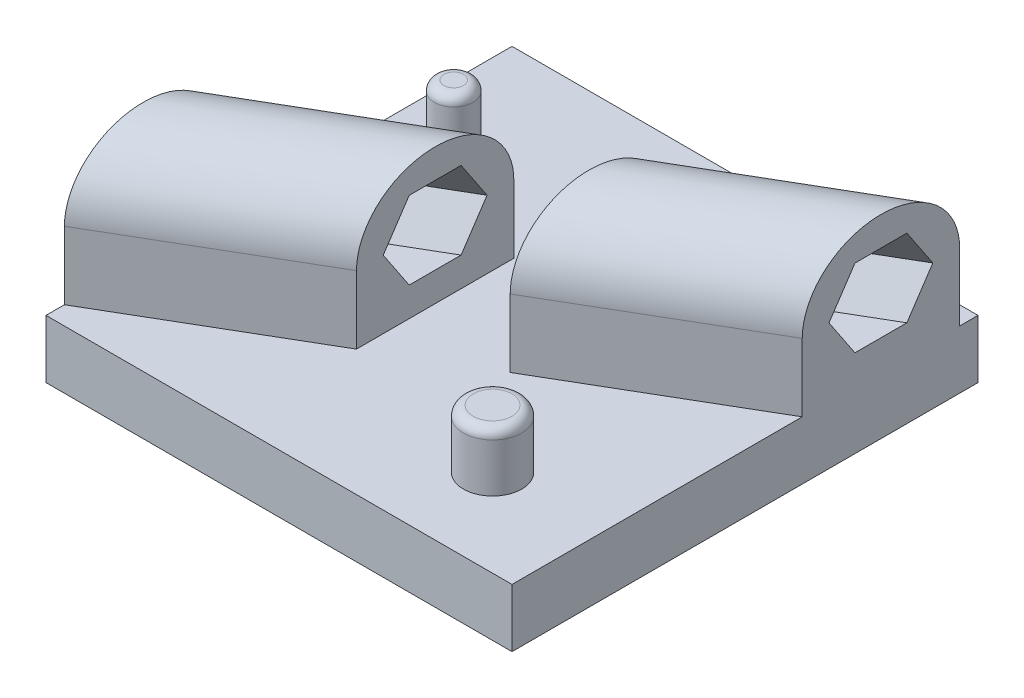
ISO-10303-21;
HEADER;
FILE_DESCRIPTION(('STEP AP214'),'2;1');
FILE_NAME('part.step','',(''),(''),'','','');
FILE_SCHEMA(('AUTOMOTIVE_DESIGN { 1 0 10303 214 1 1 1 1 }'));
ENDSEC;
DATA;
#1=APPLICATION_CONTEXT('core data for automotive mechanical design processes');
#2=APPLICATION_PROTOCOL_DEFINITION('international standard','automotive_design',2000,#1);
#3=PRODUCT_CONTEXT('',#1,'mechanical');
#4=PRODUCT('Part','Part','',(#3));
#5=PRODUCT_RELATED_PRODUCT_CATEGORY('part','',(#4));
#6=PRODUCT_DEFINITION_FORMATION('','',#4);
#7=PRODUCT_DEFINITION_CONTEXT('part definition',#1,'design');
#8=PRODUCT_DEFINITION('design','',#6,#7);
#9=PRODUCT_DEFINITION_SHAPE('','',#8);
#10=(LENGTH_UNIT() NAMED_UNIT(*) SI_UNIT(.MILLI.,.METRE.));
#11=(NAMED_UNIT(*) PLANE_ANGLE_UNIT() SI_UNIT($,.RADIAN.));
#12=(NAMED_UNIT(*) SI_UNIT($,.STERADIAN.) SOLID_ANGLE_UNIT());
#13=UNCERTAINTY_MEASURE_WITH_UNIT(LENGTH_MEASURE(1.E-05),#10,'distance_accuracy_value','');
#14=(GEOMETRIC_REPRESENTATION_CONTEXT(3) GLOBAL_UNCERTAINTY_ASSIGNED_CONTEXT((#13)) GLOBAL_UNIT_ASSIGNED_CONTEXT((#10,
#11,#12)) REPRESENTATION_CONTEXT('',''));
#15=CARTESIAN_POINT('',(0.,0.,0.));
#16=DIRECTION('',(0.,0.,1.));
#17=DIRECTION('',(1.,0.,0.));
#18=AXIS2_PLACEMENT_3D('',#15,#16,#17);
#19=CARTESIAN_POINT('',(-240.249167329031,0.,99.6257193060394));
#20=DIRECTION('',(-0.503871025524086,0.,-0.863778900898433));
#21=DIRECTION('',(-0.863778900898433,0.,0.503871025524086));
#22=AXIS2_PLACEMENT_3D('',#19,#20,#21);
#23=PLANE('',#22);
#24=DIRECTION('',(0.,1.,0.));
#25=VECTOR('',#24,1.);
#26=CARTESIAN_POINT('',(-25.,0.,-25.9362949692286));
#27=LINE('',#26,#25);
#28=CARTESIAN_POINT('',(-25.,15.,-25.9362949692286));
#29=VERTEX_POINT('',#28);
#30=CARTESIAN_POINT('',(-25.,50.,-25.9362949692286));
#31=VERTEX_POINT('',#30);
#32=EDGE_CURVE('E399',#29,#31,#27,.T.);
#33=ORIENTED_EDGE('',*,*,#32,.F.);
#34=DIRECTION('',(0.863778900898433,0.,-0.503871025524086));
#35=VECTOR('',#34,1.);
#36=CARTESIAN_POINT('',(19.6702135885223,15.,-51.9939195625333));
#37=LINE('',#36,#35);
#38=CARTESIAN_POINT('',(-120.,15.,29.480371697438));
#39=VERTEX_POINT('',#38);
#40=EDGE_CURVE('E223',#39,#29,#37,.T.);
#41=ORIENTED_EDGE('',*,*,#40,.F.);
#42=DIRECTION('',(0.,-1.,0.));
#43=VECTOR('',#42,1.);
#44=CARTESIAN_POINT('',(-120.,0.,29.4803716974381));
#45=LINE('',#44,#43);
#46=CARTESIAN_POINT('',(-120.,50.,29.480371697438));
#47=VERTEX_POINT('',#46);
#48=EDGE_CURVE('E225',#47,#39,#45,.T.);
#49=ORIENTED_EDGE('',*,*,#48,.F.);
#50=DIRECTION('',(0.863778900898433,0.,-0.503871025524086));
#51=VECTOR('',#50,1.);
#52=CARTESIAN_POINT('',(-240.249167329031,50.,99.6257193060394));
#53=LINE('',#52,#51);
#54=EDGE_CURVE('E327',#47,#31,#53,.T.);
#55=ORIENTED_EDGE('',*,*,#54,.T.);
#56=EDGE_LOOP('',(#33,#41,#49,#55));
#57=FACE_BOUND('',#56,.T.);
#58=ADVANCED_FACE('F35',(#57),#23,.T.);
#59=CARTESIAN_POINT('',(-204.978195542345,0.,160.09024236893));
#60=DIRECTION('',(0.503871025524086,0.,0.863778900898433));
#61=DIRECTION('',(0.863778900898433,0.,-0.503871025524086));
#62=AXIS2_PLACEMENT_3D('',#59,#60,#61);
#63=PLANE('',#62);
#64=DIRECTION('',(0.,-1.,0.));
#65=VECTOR('',#64,1.);
#66=CARTESIAN_POINT('',(-25.,0.,55.1029616358953));
#67=LINE('',#66,#65);
#68=CARTESIAN_POINT('',(-25.,50.,55.1029616358952));
#69=VERTEX_POINT('',#68);
#70=CARTESIAN_POINT('',(-25.,15.,55.1029616358953));
#71=VERTEX_POINT('',#70);
#72=EDGE_CURVE('E403',#69,#71,#67,.T.);
#73=ORIENTED_EDGE('',*,*,#72,.F.);
#74=DIRECTION('',(0.863778900898433,0.,-0.503871025524086));
#75=VECTOR('',#74,1.);
#76=CARTESIAN_POINT('',(-204.978195542345,50.,160.09024236893));
#77=LINE('',#76,#75);
#78=CARTESIAN_POINT('',(-120.,50.,110.519628302562));
#79=VERTEX_POINT('',#78);
#80=EDGE_CURVE('E334',#79,#69,#77,.T.);
#81=ORIENTED_EDGE('',*,*,#80,.F.);
#82=DIRECTION('',(0.,1.,0.));
#83=VECTOR('',#82,1.);
#84=CARTESIAN_POINT('',(-120.,0.,110.519628302562));
#85=LINE('',#84,#83);
#86=CARTESIAN_POINT('',(-120.,15.,110.519628302562));
#87=VERTEX_POINT('',#86);
#88=EDGE_CURVE('E357',#87,#79,#85,.T.);
#89=ORIENTED_EDGE('',*,*,#88,.F.);
#90=DIRECTION('',(-0.863778900898433,0.,0.503871025524086));
#91=VECTOR('',#90,1.);
#92=CARTESIAN_POINT('',(54.9411853752083,15.,8.47060350035708));
#93=LINE('',#92,#91);
#94=EDGE_CURVE('E221',#71,#87,#93,.T.);
#95=ORIENTED_EDGE('',*,*,#94,.F.);
#96=EDGE_LOOP('',(#73,#81,#89,#95));
#97=FACE_BOUND('',#96,.T.);
#98=ADVANCED_FACE('F292',(#97),#63,.T.);
#99=CARTESIAN_POINT('',(-222.613681435688,50.,129.857980837485));
#100=DIRECTION('',(0.863778900898433,0.,-0.503871025524086));
#101=DIRECTION('',(-0.503871025524086,0.,-0.863778900898433));
#102=AXIS2_PLACEMENT_3D('',#99,#100,#101);
#103=CYLINDRICAL_SURFACE('',#102,35.);
#104=ORIENTED_EDGE('',*,*,#80,.T.);
#105=CARTESIAN_POINT('',(-25.,50.,14.5833333333333));
#106=DIRECTION('',(-1.,0.,0.));
#107=DIRECTION('',(0.,0.,-1.));
#108=AXIS2_PLACEMENT_3D('',#105,#106,#107);
#109=ELLIPSE('',#108,40.5196283025619,35.);
#110=EDGE_CURVE('E405',#31,#69,#109,.F.);
#111=ORIENTED_EDGE('',*,*,#110,.F.);
#112=ORIENTED_EDGE('',*,*,#54,.F.);
#113=CARTESIAN_POINT('',(-120.,50.,70.));
#114=DIRECTION('',(1.,0.,0.));
#115=DIRECTION('',(0.,0.,-1.));
#116=AXIS2_PLACEMENT_3D('',#113,#114,#115);
#117=ELLIPSE('',#116,40.5196283025619,35.);
#118=EDGE_CURVE('E360',#79,#47,#117,.F.);
#119=ORIENTED_EDGE('',*,*,#118,.F.);
#120=EDGE_LOOP('',(#104,#111,#112,#119));
#121=FACE_BOUND('',#120,.T.);
#122=ADVANCED_FACE('F300',(#121),#103,.T.);
#123=CARTESIAN_POINT('',(-234.250084324615,50.,109.909861599323));
#124=DIRECTION('',(-0.436365108334776,0.5,-0.748054471431045));
#125=DIRECTION('',(0.,0.831384387633061,0.555697759577992));
#126=AXIS2_PLACEMENT_3D('',#123,#124,#125);
#127=PLANE('',#126);
#128=DIRECTION('',(0.863778900898433,0.,-0.503871025524086));
#129=VECTOR('',#128,1.);
#130=CARTESIAN_POINT('',(-234.250084324615,50.,109.909861599323));
#131=LINE('',#130,#129);
#132=CARTESIAN_POINT('',(-120.,50.,43.2639790766312));
#133=VERTEX_POINT('',#132);
#134=CARTESIAN_POINT('',(-25.,50.,-12.1526875900355));
#135=VERTEX_POINT('',#134);
#136=EDGE_CURVE('E337',#133,#135,#131,.T.);
#137=ORIENTED_EDGE('',*,*,#136,.T.);
#138=DIRECTION('',(0.,0.831384387633061,0.555697759577992));
#139=VECTOR('',#138,1.);
#140=CARTESIAN_POINT('',(-25.,106.392707497814,25.5402275996385));
#141=LINE('',#140,#139);
#142=CARTESIAN_POINT('',(-25.,70.,1.21532287164892));
#143=VERTEX_POINT('',#142);
#144=EDGE_CURVE('E58',#135,#143,#141,.T.);
#145=ORIENTED_EDGE('',*,*,#144,.T.);
#146=DIRECTION('',(0.863778900898433,0.,-0.503871025524086));
#147=VECTOR('',#146,1.);
#148=CARTESIAN_POINT('',(-228.431882880152,70.,119.883921218404));
#149=LINE('',#148,#147);
#150=CARTESIAN_POINT('',(-120.,70.,56.6319895383156));
#151=VERTEX_POINT('',#150);
#152=EDGE_CURVE('E342',#151,#143,#149,.T.);
#153=ORIENTED_EDGE('',*,*,#152,.F.);
#154=DIRECTION('',(0.,-0.831384387633061,-0.555697759577992));
#155=VECTOR('',#154,1.);
#156=CARTESIAN_POINT('',(-120.,80.7902938615956,63.8442275996386));
#157=LINE('',#156,#155);
#158=EDGE_CURVE('E227',#151,#133,#157,.T.);
#159=ORIENTED_EDGE('',*,*,#158,.T.);
#160=EDGE_LOOP('',(#137,#145,#153,#159));
#161=FACE_BOUND('',#160,.T.);
#162=ADVANCED_FACE('F543',(#161),#127,.F.);
#163=CARTESIAN_POINT('',(-228.431882880152,70.,119.883921218404));
#164=DIRECTION('',(0.,1.,0.));
#165=DIRECTION('',(-1.,0.,0.));
#166=AXIS2_PLACEMENT_3D('',#163,#164,#165);
#167=PLANE('',#166);
#168=ORIENTED_EDGE('',*,*,#152,.T.);
#169=DIRECTION('',(0.,0.,1.));
#170=VECTOR('',#169,1.);
#171=CARTESIAN_POINT('',(-25.,70.,119.883921218404));
#172=LINE('',#171,#170);
#173=CARTESIAN_POINT('',(-25.,70.,27.9513437950177));
#174=VERTEX_POINT('',#173);
#175=EDGE_CURVE('E408',#143,#174,#172,.T.);
#176=ORIENTED_EDGE('',*,*,#175,.T.);
#177=DIRECTION('',(0.863778900898433,0.,-0.503871025524086));
#178=VECTOR('',#177,1.);
#179=CARTESIAN_POINT('',(-216.795479991224,70.,139.832040456565));
#180=LINE('',#179,#178);
#181=CARTESIAN_POINT('',(-120.,70.,83.3680104616844));
#182=VERTEX_POINT('',#181);
#183=EDGE_CURVE('E346',#182,#174,#180,.T.);
#184=ORIENTED_EDGE('',*,*,#183,.F.);
#185=DIRECTION('',(0.,0.,-1.));
#186=VECTOR('',#185,1.);
#187=CARTESIAN_POINT('',(-120.,70.,119.883921218404));
#188=LINE('',#187,#186);
#189=EDGE_CURVE('E364',#182,#151,#188,.T.);
#190=ORIENTED_EDGE('',*,*,#189,.T.);
#191=EDGE_LOOP('',(#168,#176,#184,#190));
#192=FACE_BOUND('',#191,.T.);
#193=ADVANCED_FACE('F534',(#192),#167,.F.);
#194=CARTESIAN_POINT('',(-216.795479991224,70.,139.832040456565));
#195=DIRECTION('',(0.436365108334776,0.5,0.748054471431044));
#196=DIRECTION('',(0.,-0.831384387633061,0.555697759577992));
#197=AXIS2_PLACEMENT_3D('',#194,#195,#196);
#198=PLANE('',#197);
#199=ORIENTED_EDGE('',*,*,#183,.T.);
#200=DIRECTION('',(0.,-0.831384387633061,0.555697759577992));
#201=VECTOR('',#200,1.);
#202=CARTESIAN_POINT('',(-25.,18.3112925021864,62.5001029241036));
#203=LINE('',#202,#201);
#204=CARTESIAN_POINT('',(-25.,50.,41.3193542567022));
#205=VERTEX_POINT('',#204);
#206=EDGE_CURVE('E411',#174,#205,#203,.T.);
#207=ORIENTED_EDGE('',*,*,#206,.T.);
#208=DIRECTION('',(0.863778900898433,0.,-0.503871025524086));
#209=VECTOR('',#208,1.);
#210=CARTESIAN_POINT('',(-210.97727854676,50.,149.806100075646));
#211=LINE('',#210,#209);
#212=CARTESIAN_POINT('',(-120.,50.,96.7360209233688));
#213=VERTEX_POINT('',#212);
#214=EDGE_CURVE('E350',#213,#205,#211,.T.);
#215=ORIENTED_EDGE('',*,*,#214,.F.);
#216=DIRECTION('',(0.,0.831384387633061,-0.555697759577992));
#217=VECTOR('',#216,1.);
#218=CARTESIAN_POINT('',(-120.,43.9137061384044,100.804102924104));
#219=LINE('',#218,#217);
#220=EDGE_CURVE('E373',#213,#182,#219,.T.);
#221=ORIENTED_EDGE('',*,*,#220,.T.);
#222=EDGE_LOOP('',(#199,#207,#215,#221));
#223=FACE_BOUND('',#222,.T.);
#224=ADVANCED_FACE('F528',(#223),#198,.F.);
#225=CARTESIAN_POINT('',(-210.97727854676,50.,149.806100075646));
#226=DIRECTION('',(0.436365108334776,-0.5,0.748054471431045));
#227=DIRECTION('',(0.,-0.831384387633061,-0.555697759577992));
#228=AXIS2_PLACEMENT_3D('',#225,#226,#227);
#229=PLANE('',#228);
#230=ORIENTED_EDGE('',*,*,#214,.T.);
#231=DIRECTION('',(0.,-0.831384387633061,-0.555697759577992));
#232=VECTOR('',#231,1.);
#233=CARTESIAN_POINT('',(-25.,100.120707497814,74.8200613655919));
#234=LINE('',#233,#232);
#235=CARTESIAN_POINT('',(-25.,30.,27.9513437950177));
#236=VERTEX_POINT('',#235);
#237=EDGE_CURVE('E414',#205,#236,#234,.T.);
#238=ORIENTED_EDGE('',*,*,#237,.T.);
#239=DIRECTION('',(0.863778900898433,0.,-0.503871025524086));
#240=VECTOR('',#239,1.);
#241=CARTESIAN_POINT('',(-216.795479991224,30.,139.832040456565));
#242=LINE('',#241,#240);
#243=CARTESIAN_POINT('',(-120.,30.,83.3680104616844));
#244=VERTEX_POINT('',#243);
#245=EDGE_CURVE('E354',#244,#236,#242,.T.);
#246=ORIENTED_EDGE('',*,*,#245,.F.);
#247=DIRECTION('',(0.,0.831384387633061,0.555697759577992));
#248=VECTOR('',#247,1.);
#249=CARTESIAN_POINT('',(-120.,74.5182938615956,113.124061365592));
#250=LINE('',#249,#248);
#251=EDGE_CURVE('E370',#244,#213,#250,.T.);
#252=ORIENTED_EDGE('',*,*,#251,.T.);
#253=EDGE_LOOP('',(#230,#238,#246,#252));
#254=FACE_BOUND('',#253,.T.);
#255=ADVANCED_FACE('F489',(#254),#229,.F.);
#256=CARTESIAN_POINT('',(-216.795479991224,30.,139.832040456565));
#257=DIRECTION('',(0.,-1.,0.));
#258=DIRECTION('',(1.,0.,0.));
#259=AXIS2_PLACEMENT_3D('',#256,#257,#258);
#260=PLANE('',#259);
#261=ORIENTED_EDGE('',*,*,#245,.T.);
#262=DIRECTION('',(0.,0.,-1.));
#263=VECTOR('',#262,1.);
#264=CARTESIAN_POINT('',(-25.,30.,139.832040456565));
#265=LINE('',#264,#263);
#266=CARTESIAN_POINT('',(-25.,30.,1.21532287164894));
#267=VERTEX_POINT('',#266);
#268=EDGE_CURVE('E321',#236,#267,#265,.T.);
#269=ORIENTED_EDGE('',*,*,#268,.T.);
#270=DIRECTION('',(0.863778900898433,0.,-0.503871025524086));
#271=VECTOR('',#270,1.);
#272=CARTESIAN_POINT('',(-228.431882880152,30.,119.883921218404));
#273=LINE('',#272,#271);
#274=CARTESIAN_POINT('',(-120.,30.,56.6319895383156));
#275=VERTEX_POINT('',#274);
#276=EDGE_CURVE('E328',#275,#267,#273,.T.);
#277=ORIENTED_EDGE('',*,*,#276,.F.);
#278=DIRECTION('',(0.,0.,1.));
#279=VECTOR('',#278,1.);
#280=CARTESIAN_POINT('',(-120.,30.,139.832040456565));
#281=LINE('',#280,#279);
#282=EDGE_CURVE('E367',#275,#244,#281,.T.);
#283=ORIENTED_EDGE('',*,*,#282,.T.);
#284=EDGE_LOOP('',(#261,#269,#277,#283));
#285=FACE_BOUND('',#284,.T.);
#286=ADVANCED_FACE('F482',(#285),#260,.F.);
#287=CARTESIAN_POINT('',(-228.431882880152,30.,119.883921218404));
#288=DIRECTION('',(-0.436365108334776,-0.5,-0.748054471431044));
#289=DIRECTION('',(0.,0.831384387633061,-0.555697759577992));
#290=AXIS2_PLACEMENT_3D('',#287,#288,#289);
#291=PLANE('',#290);
#292=ORIENTED_EDGE('',*,*,#276,.T.);
#293=DIRECTION('',(0.,0.831384387633061,-0.555697759577992));
#294=VECTOR('',#293,1.);
#295=CARTESIAN_POINT('',(-25.,-24.8247074978136,37.8601860411269));
#296=LINE('',#295,#294);
#297=EDGE_CURVE('E264',#267,#135,#296,.T.);
#298=ORIENTED_EDGE('',*,*,#297,.T.);
#299=ORIENTED_EDGE('',*,*,#136,.F.);
#300=DIRECTION('',(0.,-0.831384387633061,0.555697759577992));
#301=VECTOR('',#300,1.);
#302=CARTESIAN_POINT('',(-120.,0.777706138404378,76.1641860411269));
#303=LINE('',#302,#301);
#304=EDGE_CURVE('E359',#133,#275,#303,.T.);
#305=ORIENTED_EDGE('',*,*,#304,.T.);
#306=EDGE_LOOP('',(#292,#298,#299,#305));
#307=FACE_BOUND('',#306,.T.);
#308=ADVANCED_FACE('F478',(#307),#291,.F.);
#309=CARTESIAN_POINT('',(120.,15.,120.));
#310=DIRECTION('',(-1.,0.,0.));
#311=DIRECTION('',(0.,0.,1.));
#312=AXIS2_PLACEMENT_3D('',#309,#310,#311);
#313=PLANE('',#312);
#314=DIRECTION('',(0.,1.,0.));
#315=VECTOR('',#314,1.);
#316=CARTESIAN_POINT('',(120.,0.,-29.4803716974381));
#317=LINE('',#316,#315);
#318=CARTESIAN_POINT('',(120.,15.,-29.4803716974381));
#319=VERTEX_POINT('',#318);
#320=CARTESIAN_POINT('',(120.,50.,-29.4803716974381));
#321=VERTEX_POINT('',#320);
#322=EDGE_CURVE('E394',#319,#321,#317,.T.);
#323=ORIENTED_EDGE('',*,*,#322,.F.);
#324=DIRECTION('',(0.,0.,-1.));
#325=VECTOR('',#324,1.);
#326=CARTESIAN_POINT('',(120.,15.,120.));
#327=LINE('',#326,#325);
#328=CARTESIAN_POINT('',(120.,15.,120.));
#329=VERTEX_POINT('',#328);
#330=EDGE_CURVE('E219',#329,#319,#327,.T.);
#331=ORIENTED_EDGE('',*,*,#330,.F.);
#332=DIRECTION('',(0.,1.,0.));
#333=VECTOR('',#332,1.);
#334=CARTESIAN_POINT('',(120.,15.,120.));
#335=LINE('',#334,#333);
#336=CARTESIAN_POINT('',(120.,-15.,120.));
#337=VERTEX_POINT('',#336);
#338=EDGE_CURVE('E232',#337,#329,#335,.T.);
#339=ORIENTED_EDGE('',*,*,#338,.F.);
#340=DIRECTION('',(0.,0.,-1.));
#341=VECTOR('',#340,1.);
#342=CARTESIAN_POINT('',(120.,-15.,120.));
#343=LINE('',#342,#341);
#344=CARTESIAN_POINT('',(120.,-15.,-120.));
#345=VERTEX_POINT('',#344);
#346=EDGE_CURVE('E242',#337,#345,#343,.T.);
#347=ORIENTED_EDGE('',*,*,#346,.T.);
#348=DIRECTION('',(0.,1.,0.));
#349=VECTOR('',#348,1.);
#350=CARTESIAN_POINT('',(120.,15.,-120.));
#351=LINE('',#350,#349);
#352=CARTESIAN_POINT('',(120.,15.,-120.));
#353=VERTEX_POINT('',#352);
#354=EDGE_CURVE('E231',#345,#353,#351,.T.);
#355=ORIENTED_EDGE('',*,*,#354,.T.);
#356=CARTESIAN_POINT('',(120.,15.,-110.519628302562));
#357=VERTEX_POINT('',#356);
#358=EDGE_CURVE('E260',#357,#353,#327,.T.);
#359=ORIENTED_EDGE('',*,*,#358,.F.);
#360=DIRECTION('',(0.,-1.,0.));
#361=VECTOR('',#360,1.);
#362=CARTESIAN_POINT('',(120.,0.,-110.519628302562));
#363=LINE('',#362,#361);
#364=CARTESIAN_POINT('',(120.,50.,-110.519628302562));
#365=VERTEX_POINT('',#364);
#366=EDGE_CURVE('E397',#365,#357,#363,.T.);
#367=ORIENTED_EDGE('',*,*,#366,.F.);
#368=CARTESIAN_POINT('',(120.,50.,-70.0000000000001));
#369=DIRECTION('',(-1.,0.,0.));
#370=DIRECTION('',(0.,0.,1.));
#371=AXIS2_PLACEMENT_3D('',#368,#369,#370);
#372=ELLIPSE('',#371,40.5196283025619,35.);
#373=EDGE_CURVE('E326',#321,#365,#372,.T.);
#374=ORIENTED_EDGE('',*,*,#373,.F.);
#375=EDGE_LOOP('',(#323,#331,#339,#347,#355,#359,#367,#374));
#376=FACE_BOUND('',#375,.T.);
#377=DIRECTION('',(0.,-0.831384387633061,0.555697759577992));
#378=VECTOR('',#377,1.);
#379=CARTESIAN_POINT('',(120.,56.0862938615957,-100.804102924104));
#380=LINE('',#379,#378);
#381=CARTESIAN_POINT('',(120.,50.,-96.7360209233688));
#382=VERTEX_POINT('',#381);
#383=CARTESIAN_POINT('',(120.,30.,-83.3680104616844));
#384=VERTEX_POINT('',#383);
#385=EDGE_CURVE('E391',#382,#384,#380,.T.);
#386=ORIENTED_EDGE('',*,*,#385,.T.);
#387=DIRECTION('',(0.,0.,1.));
#388=VECTOR('',#387,1.);
#389=CARTESIAN_POINT('',(120.,30.,-119.883921218404));
#390=LINE('',#389,#388);
#391=CARTESIAN_POINT('',(120.,30.,-56.6319895383156));
#392=VERTEX_POINT('',#391);
#393=EDGE_CURVE('E382',#384,#392,#390,.T.);
#394=ORIENTED_EDGE('',*,*,#393,.T.);
#395=DIRECTION('',(0.,0.831384387633061,0.555697759577992));
#396=VECTOR('',#395,1.);
#397=CARTESIAN_POINT('',(120.,19.2097061384044,-63.8442275996386));
#398=LINE('',#397,#396);
#399=CARTESIAN_POINT('',(120.,50.,-43.2639790766312));
#400=VERTEX_POINT('',#399);
#401=EDGE_CURVE('E378',#392,#400,#398,.T.);
#402=ORIENTED_EDGE('',*,*,#401,.T.);
#403=DIRECTION('',(0.,0.831384387633061,-0.555697759577992));
#404=VECTOR('',#403,1.);
#405=CARTESIAN_POINT('',(120.,99.2222938615956,-76.164186041127));
#406=LINE('',#405,#404);
#407=CARTESIAN_POINT('',(120.,70.,-56.6319895383157));
#408=VERTEX_POINT('',#407);
#409=EDGE_CURVE('E381',#400,#408,#406,.T.);
#410=ORIENTED_EDGE('',*,*,#409,.T.);
#411=DIRECTION('',(0.,0.,-1.));
#412=VECTOR('',#411,1.);
#413=CARTESIAN_POINT('',(120.,70.,-139.832040456565));
#414=LINE('',#413,#412);
#415=CARTESIAN_POINT('',(120.,70.,-83.3680104616844));
#416=VERTEX_POINT('',#415);
#417=EDGE_CURVE('E385',#408,#416,#414,.T.);
#418=ORIENTED_EDGE('',*,*,#417,.T.);
#419=DIRECTION('',(0.,-0.831384387633061,-0.555697759577992));
#420=VECTOR('',#419,1.);
#421=CARTESIAN_POINT('',(120.,25.4817061384044,-113.124061365592));
#422=LINE('',#421,#420);
#423=EDGE_CURVE('E388',#416,#382,#422,.T.);
#424=ORIENTED_EDGE('',*,*,#423,.T.);
#425=EDGE_LOOP('',(#386,#394,#402,#410,#418,#424));
#426=FACE_BOUND('',#425,.T.);
#427=ADVANCED_FACE('F459',(#376,#426),#313,.F.);
#428=CARTESIAN_POINT('',(120.,15.,120.));
#429=DIRECTION('',(0.,-1.,0.));
#430=DIRECTION('',(1.,0.,0.));
#431=AXIS2_PLACEMENT_3D('',#428,#429,#430);
#432=PLANE('',#431);
#433=CARTESIAN_POINT('',(65.,15.,75.));
#434=DIRECTION('',(0.,-1.,0.));
#435=DIRECTION('',(1.,0.,0.));
#436=AXIS2_PLACEMENT_3D('',#433,#434,#435);
#437=CIRCLE('',#436,15.);
#438=CARTESIAN_POINT('',(80.,15.,75.));
#439=VERTEX_POINT('',#438);
#440=EDGE_CURVE('E269',#439,#439,#437,.F.);
#441=ORIENTED_EDGE('',*,*,#440,.F.);
#442=EDGE_LOOP('',(#441));
#443=FACE_BOUND('',#442,.T.);
#444=CARTESIAN_POINT('',(-90.,15.,-60.));
#445=DIRECTION('',(0.,-1.,0.));
#446=DIRECTION('',(1.,0.,0.));
#447=AXIS2_PLACEMENT_3D('',#444,#445,#446);
#448=CIRCLE('',#447,9.99999999999999);
#449=CARTESIAN_POINT('',(-80.,15.,-60.));
#450=VERTEX_POINT('',#449);
#451=EDGE_CURVE('E266',#450,#450,#448,.F.);
#452=ORIENTED_EDGE('',*,*,#451,.F.);
#453=EDGE_LOOP('',(#452));
#454=FACE_BOUND('',#453,.T.);
#455=DIRECTION('',(0.,0.,-1.));
#456=VECTOR('',#455,1.);
#457=CARTESIAN_POINT('',(25.,15.,180.));
#458=LINE('',#457,#456);
#459=CARTESIAN_POINT('',(25.,15.,25.9362949692286));
#460=VERTEX_POINT('',#459);
#461=CARTESIAN_POINT('',(25.,15.,-55.1029616358953));
#462=VERTEX_POINT('',#461);
#463=EDGE_CURVE('E196',#460,#462,#458,.T.);
#464=ORIENTED_EDGE('',*,*,#463,.T.);
#465=EDGE_CURVE('E220',#462,#357,#37,.T.);
#466=ORIENTED_EDGE('',*,*,#465,.T.);
#467=ORIENTED_EDGE('',*,*,#358,.T.);
#468=DIRECTION('',(-1.,0.,0.));
#469=VECTOR('',#468,1.);
#470=CARTESIAN_POINT('',(120.,15.,-120.));
#471=LINE('',#470,#469);
#472=CARTESIAN_POINT('',(-120.,15.,-120.));
#473=VERTEX_POINT('',#472);
#474=EDGE_CURVE('E245',#353,#473,#471,.T.);
#475=ORIENTED_EDGE('',*,*,#474,.T.);
#476=DIRECTION('',(0.,0.,-1.));
#477=VECTOR('',#476,1.);
#478=CARTESIAN_POINT('',(-120.,15.,120.));
#479=LINE('',#478,#477);
#480=EDGE_CURVE('E256',#39,#473,#479,.T.);
#481=ORIENTED_EDGE('',*,*,#480,.F.);
#482=ORIENTED_EDGE('',*,*,#40,.T.);
#483=DIRECTION('',(0.,0.,-1.));
#484=VECTOR('',#483,1.);
#485=CARTESIAN_POINT('',(-25.,15.,180.));
#486=LINE('',#485,#484);
#487=EDGE_CURVE('E206',#71,#29,#486,.T.);
#488=ORIENTED_EDGE('',*,*,#487,.F.);
#489=ORIENTED_EDGE('',*,*,#94,.T.);
#490=CARTESIAN_POINT('',(-120.,15.,120.));
#491=VERTEX_POINT('',#490);
#492=EDGE_CURVE('E257',#491,#87,#479,.T.);
#493=ORIENTED_EDGE('',*,*,#492,.F.);
#494=DIRECTION('',(-1.,0.,0.));
#495=VECTOR('',#494,1.);
#496=CARTESIAN_POINT('',(120.,15.,120.));
#497=LINE('',#496,#495);
#498=EDGE_CURVE('E235',#329,#491,#497,.T.);
#499=ORIENTED_EDGE('',*,*,#498,.F.);
#500=ORIENTED_EDGE('',*,*,#330,.T.);
#501=EDGE_CURVE('E212',#319,#460,#93,.T.);
#502=ORIENTED_EDGE('',*,*,#501,.T.);
#503=EDGE_LOOP('',(#464,#466,#467,#475,#481,#482,#488,#489,#493,#499,#500,#502));
#504=FACE_BOUND('',#503,.T.);
#505=ADVANCED_FACE('F217',(#443,#454,#504),#432,.F.);
#506=CARTESIAN_POINT('',(-120.,15.,120.));
#507=DIRECTION('',(1.,0.,0.));
#508=DIRECTION('',(0.,0.,-1.));
#509=AXIS2_PLACEMENT_3D('',#506,#507,#508);
#510=PLANE('',#509);
#511=ORIENTED_EDGE('',*,*,#492,.T.);
#512=ORIENTED_EDGE('',*,*,#88,.T.);
#513=ORIENTED_EDGE('',*,*,#118,.T.);
#514=ORIENTED_EDGE('',*,*,#48,.T.);
#515=ORIENTED_EDGE('',*,*,#480,.T.);
#516=DIRECTION('',(0.,-1.,0.));
#517=VECTOR('',#516,1.);
#518=CARTESIAN_POINT('',(-120.,15.,-120.));
#519=LINE('',#518,#517);
#520=CARTESIAN_POINT('',(-120.,-15.,-120.));
#521=VERTEX_POINT('',#520);
#522=EDGE_CURVE('E248',#473,#521,#519,.T.);
#523=ORIENTED_EDGE('',*,*,#522,.T.);
#524=DIRECTION('',(0.,0.,-1.));
#525=VECTOR('',#524,1.);
#526=CARTESIAN_POINT('',(-120.,-15.,120.));
#527=LINE('',#526,#525);
#528=CARTESIAN_POINT('',(-120.,-15.,120.));
#529=VERTEX_POINT('',#528);
#530=EDGE_CURVE('E253',#529,#521,#527,.T.);
#531=ORIENTED_EDGE('',*,*,#530,.F.);
#532=DIRECTION('',(0.,-1.,0.));
#533=VECTOR('',#532,1.);
#534=CARTESIAN_POINT('',(-120.,15.,120.));
#535=LINE('',#534,#533);
#536=EDGE_CURVE('E238',#491,#529,#535,.T.);
#537=ORIENTED_EDGE('',*,*,#536,.F.);
#538=EDGE_LOOP('',(#511,#512,#513,#514,#515,#523,#531,#537));
#539=FACE_BOUND('',#538,.T.);
#540=ORIENTED_EDGE('',*,*,#158,.F.);
#541=ORIENTED_EDGE('',*,*,#189,.F.);
#542=ORIENTED_EDGE('',*,*,#220,.F.);
#543=ORIENTED_EDGE('',*,*,#251,.F.);
#544=ORIENTED_EDGE('',*,*,#282,.F.);
#545=ORIENTED_EDGE('',*,*,#304,.F.);
#546=EDGE_LOOP('',(#540,#541,#542,#543,#544,#545));
#547=FACE_BOUND('',#546,.T.);
#548=ADVANCED_FACE('F445',(#539,#547),#510,.F.);
#549=CARTESIAN_POINT('',(120.,-15.,120.));
#550=DIRECTION('',(0.,1.,0.));
#551=DIRECTION('',(-1.,0.,0.));
#552=AXIS2_PLACEMENT_3D('',#549,#550,#551);
#553=PLANE('',#552);
#554=DIRECTION('',(1.,0.,0.));
#555=VECTOR('',#554,1.);
#556=CARTESIAN_POINT('',(120.,-15.,-120.));
#557=LINE('',#556,#555);
#558=EDGE_CURVE('E236',#521,#345,#557,.T.);
#559=ORIENTED_EDGE('',*,*,#558,.T.);
#560=ORIENTED_EDGE('',*,*,#346,.F.);
#561=DIRECTION('',(1.,0.,0.));
#562=VECTOR('',#561,1.);
#563=CARTESIAN_POINT('',(120.,-15.,120.));
#564=LINE('',#563,#562);
#565=EDGE_CURVE('E240',#529,#337,#564,.T.);
#566=ORIENTED_EDGE('',*,*,#565,.F.);
#567=ORIENTED_EDGE('',*,*,#530,.T.);
#568=EDGE_LOOP('',(#559,#560,#566,#567));
#569=FACE_BOUND('',#568,.T.);
#570=ADVANCED_FACE('F465',(#569),#553,.F.);
#571=CARTESIAN_POINT('',(0.,0.,120.));
#572=DIRECTION('',(0.,0.,-1.));
#573=DIRECTION('',(-1.,0.,0.));
#574=AXIS2_PLACEMENT_3D('',#571,#572,#573);
#575=PLANE('',#574);
#576=ORIENTED_EDGE('',*,*,#338,.T.);
#577=ORIENTED_EDGE('',*,*,#498,.T.);
#578=ORIENTED_EDGE('',*,*,#536,.T.);
#579=ORIENTED_EDGE('',*,*,#565,.T.);
#580=EDGE_LOOP('',(#576,#577,#578,#579));
#581=FACE_BOUND('',#580,.T.);
#582=ADVANCED_FACE('F314',(#581),#575,.F.);
#583=CARTESIAN_POINT('',(0.,0.,-120.));
#584=DIRECTION('',(0.,0.,-1.));
#585=DIRECTION('',(-1.,0.,0.));
#586=AXIS2_PLACEMENT_3D('',#583,#584,#585);
#587=PLANE('',#586);
#588=ORIENTED_EDGE('',*,*,#354,.F.);
#589=ORIENTED_EDGE('',*,*,#558,.F.);
#590=ORIENTED_EDGE('',*,*,#522,.F.);
#591=ORIENTED_EDGE('',*,*,#474,.F.);
#592=EDGE_LOOP('',(#588,#589,#590,#591));
#593=FACE_BOUND('',#592,.T.);
#594=ADVANCED_FACE('F307',(#593),#587,.T.);
#595=DIRECTION('',(0.,-1.,0.));
#596=VECTOR('',#595,1.);
#597=CARTESIAN_POINT('',(25.,0.,-55.1029616358953));
#598=LINE('',#597,#596);
#599=CARTESIAN_POINT('',(25.,50.,-55.1029616358953));
#600=VERTEX_POINT('',#599);
#601=EDGE_CURVE('E202',#600,#462,#598,.T.);
#602=ORIENTED_EDGE('',*,*,#601,.F.);
#603=EDGE_CURVE('E319',#600,#365,#53,.T.);
#604=ORIENTED_EDGE('',*,*,#603,.T.);
#605=ORIENTED_EDGE('',*,*,#366,.T.);
#606=ORIENTED_EDGE('',*,*,#465,.F.);
#607=EDGE_LOOP('',(#602,#604,#605,#606));
#608=FACE_BOUND('',#607,.T.);
#609=ADVANCED_FACE('F295',(#608),#23,.T.);
#610=DIRECTION('',(0.,1.,0.));
#611=VECTOR('',#610,1.);
#612=CARTESIAN_POINT('',(25.,0.,25.9362949692286));
#613=LINE('',#612,#611);
#614=CARTESIAN_POINT('',(25.,50.,25.9362949692285));
#615=VERTEX_POINT('',#614);
#616=EDGE_CURVE('E199',#460,#615,#613,.T.);
#617=ORIENTED_EDGE('',*,*,#616,.F.);
#618=ORIENTED_EDGE('',*,*,#501,.F.);
#619=ORIENTED_EDGE('',*,*,#322,.T.);
#620=EDGE_CURVE('E214',#615,#321,#77,.T.);
#621=ORIENTED_EDGE('',*,*,#620,.F.);
#622=EDGE_LOOP('',(#617,#618,#619,#621));
#623=FACE_BOUND('',#622,.T.);
#624=ADVANCED_FACE('F210',(#623),#63,.T.);
#625=CARTESIAN_POINT('',(25.,50.,-14.5833333333334));
#626=DIRECTION('',(1.,0.,0.));
#627=DIRECTION('',(0.,0.,-1.));
#628=AXIS2_PLACEMENT_3D('',#625,#626,#627);
#629=ELLIPSE('',#628,40.5196283025619,35.);
#630=EDGE_CURVE('E215',#615,#600,#629,.F.);
#631=ORIENTED_EDGE('',*,*,#630,.F.);
#632=ORIENTED_EDGE('',*,*,#620,.T.);
#633=ORIENTED_EDGE('',*,*,#373,.T.);
#634=ORIENTED_EDGE('',*,*,#603,.F.);
#635=EDGE_LOOP('',(#631,#632,#633,#634));
#636=FACE_BOUND('',#635,.T.);
#637=ADVANCED_FACE('F313',(#636),#103,.T.);
#638=CARTESIAN_POINT('',(25.,70.,-27.9513437950177));
#639=VERTEX_POINT('',#638);
#640=EDGE_CURVE('E340',#639,#416,#149,.T.);
#641=ORIENTED_EDGE('',*,*,#640,.F.);
#642=DIRECTION('',(0.,-0.831384387633061,-0.555697759577992));
#643=VECTOR('',#642,1.);
#644=CARTESIAN_POINT('',(25.,119.867662043191,5.38022759963852));
#645=LINE('',#644,#643);
#646=CARTESIAN_POINT('',(25.,50.,-41.3193542567022));
#647=VERTEX_POINT('',#646);
#648=EDGE_CURVE('E420',#639,#647,#645,.T.);
#649=ORIENTED_EDGE('',*,*,#648,.T.);
#650=EDGE_CURVE('E341',#647,#382,#131,.T.);
#651=ORIENTED_EDGE('',*,*,#650,.T.);
#652=ORIENTED_EDGE('',*,*,#423,.F.);
#653=EDGE_LOOP('',(#641,#649,#651,#652));
#654=FACE_BOUND('',#653,.T.);
#655=ADVANCED_FACE('F509',(#654),#127,.F.);
#656=CARTESIAN_POINT('',(25.,70.,-1.21532287164899));
#657=VERTEX_POINT('',#656);
#658=EDGE_CURVE('E345',#657,#408,#180,.T.);
#659=ORIENTED_EDGE('',*,*,#658,.F.);
#660=DIRECTION('',(0.,0.,-1.));
#661=VECTOR('',#660,1.);
#662=CARTESIAN_POINT('',(25.,70.,119.883921218404));
#663=LINE('',#662,#661);
#664=EDGE_CURVE('E423',#657,#639,#663,.T.);
#665=ORIENTED_EDGE('',*,*,#664,.T.);
#666=ORIENTED_EDGE('',*,*,#640,.T.);
#667=ORIENTED_EDGE('',*,*,#417,.F.);
#668=EDGE_LOOP('',(#659,#665,#666,#667));
#669=FACE_BOUND('',#668,.T.);
#670=ADVANCED_FACE('F515',(#669),#167,.F.);
#671=CARTESIAN_POINT('',(25.,50.,12.1526875900355));
#672=VERTEX_POINT('',#671);
#673=EDGE_CURVE('E349',#672,#400,#211,.T.);
#674=ORIENTED_EDGE('',*,*,#673,.F.);
#675=DIRECTION('',(0.,0.831384387633061,-0.555697759577992));
#676=VECTOR('',#675,1.);
#677=CARTESIAN_POINT('',(25.,4.83633795680852,42.3401029241036));
#678=LINE('',#677,#676);
#679=EDGE_CURVE('E426',#672,#657,#678,.T.);
#680=ORIENTED_EDGE('',*,*,#679,.T.);
#681=ORIENTED_EDGE('',*,*,#658,.T.);
#682=ORIENTED_EDGE('',*,*,#409,.F.);
#683=EDGE_LOOP('',(#674,#680,#681,#682));
#684=FACE_BOUND('',#683,.T.);
#685=ADVANCED_FACE('F518',(#684),#198,.F.);
#686=CARTESIAN_POINT('',(25.,30.,-1.21532287164891));
#687=VERTEX_POINT('',#686);
#688=EDGE_CURVE('E353',#687,#392,#242,.T.);
#689=ORIENTED_EDGE('',*,*,#688,.F.);
#690=DIRECTION('',(0.,0.831384387633061,0.555697759577992));
#691=VECTOR('',#690,1.);
#692=CARTESIAN_POINT('',(25.,113.595662043191,54.6600613655919));
#693=LINE('',#692,#691);
#694=EDGE_CURVE('E429',#687,#672,#693,.T.);
#695=ORIENTED_EDGE('',*,*,#694,.T.);
#696=ORIENTED_EDGE('',*,*,#673,.T.);
#697=ORIENTED_EDGE('',*,*,#401,.F.);
#698=EDGE_LOOP('',(#689,#695,#696,#697));
#699=FACE_BOUND('',#698,.T.);
#700=ADVANCED_FACE('F501',(#699),#229,.F.);
#701=CARTESIAN_POINT('',(25.,30.,-27.9513437950178));
#702=VERTEX_POINT('',#701);
#703=EDGE_CURVE('E331',#702,#384,#273,.T.);
#704=ORIENTED_EDGE('',*,*,#703,.F.);
#705=DIRECTION('',(0.,0.,1.));
#706=VECTOR('',#705,1.);
#707=CARTESIAN_POINT('',(25.,30.,139.832040456565));
#708=LINE('',#707,#706);
#709=EDGE_CURVE('E50',#702,#687,#708,.T.);
#710=ORIENTED_EDGE('',*,*,#709,.T.);
#711=ORIENTED_EDGE('',*,*,#688,.T.);
#712=ORIENTED_EDGE('',*,*,#393,.F.);
#713=EDGE_LOOP('',(#704,#710,#711,#712));
#714=FACE_BOUND('',#713,.T.);
#715=ADVANCED_FACE('F492',(#714),#260,.F.);
#716=ORIENTED_EDGE('',*,*,#650,.F.);
#717=DIRECTION('',(0.,-0.831384387633061,0.555697759577992));
#718=VECTOR('',#717,1.);
#719=CARTESIAN_POINT('',(25.,-38.2996620431915,17.7001860411269));
#720=LINE('',#719,#718);
#721=EDGE_CURVE('E262',#647,#702,#720,.T.);
#722=ORIENTED_EDGE('',*,*,#721,.T.);
#723=ORIENTED_EDGE('',*,*,#703,.T.);
#724=ORIENTED_EDGE('',*,*,#385,.F.);
#725=EDGE_LOOP('',(#716,#722,#723,#724));
#726=FACE_BOUND('',#725,.T.);
#727=ADVANCED_FACE('F485',(#726),#291,.F.);
#728=CARTESIAN_POINT('',(-25.,15.,180.));
#729=DIRECTION('',(-1.,0.,0.));
#730=DIRECTION('',(0.,-1.,0.));
#731=AXIS2_PLACEMENT_3D('',#728,#729,#730);
#732=PLANE('',#731);
#733=ORIENTED_EDGE('',*,*,#32,.T.);
#734=ORIENTED_EDGE('',*,*,#110,.T.);
#735=ORIENTED_EDGE('',*,*,#72,.T.);
#736=ORIENTED_EDGE('',*,*,#487,.T.);
#737=EDGE_LOOP('',(#733,#734,#735,#736));
#738=FACE_BOUND('',#737,.T.);
#739=ORIENTED_EDGE('',*,*,#297,.F.);
#740=ORIENTED_EDGE('',*,*,#268,.F.);
#741=ORIENTED_EDGE('',*,*,#237,.F.);
#742=ORIENTED_EDGE('',*,*,#206,.F.);
#743=ORIENTED_EDGE('',*,*,#175,.F.);
#744=ORIENTED_EDGE('',*,*,#144,.F.);
#745=EDGE_LOOP('',(#739,#740,#741,#742,#743,#744));
#746=FACE_BOUND('',#745,.T.);
#747=ADVANCED_FACE('F435',(#738,#746),#732,.F.);
#748=CARTESIAN_POINT('',(25.,85.,180.));
#749=DIRECTION('',(1.,0.,0.));
#750=DIRECTION('',(0.,1.,0.));
#751=AXIS2_PLACEMENT_3D('',#748,#749,#750);
#752=PLANE('',#751);
#753=ORIENTED_EDGE('',*,*,#601,.T.);
#754=ORIENTED_EDGE('',*,*,#463,.F.);
#755=ORIENTED_EDGE('',*,*,#616,.T.);
#756=ORIENTED_EDGE('',*,*,#630,.T.);
#757=EDGE_LOOP('',(#753,#754,#755,#756));
#758=FACE_BOUND('',#757,.T.);
#759=ORIENTED_EDGE('',*,*,#664,.F.);
#760=ORIENTED_EDGE('',*,*,#679,.F.);
#761=ORIENTED_EDGE('',*,*,#694,.F.);
#762=ORIENTED_EDGE('',*,*,#709,.F.);
#763=ORIENTED_EDGE('',*,*,#721,.F.);
#764=ORIENTED_EDGE('',*,*,#648,.F.);
#765=EDGE_LOOP('',(#759,#760,#761,#762,#763,#764));
#766=FACE_BOUND('',#765,.T.);
#767=ADVANCED_FACE('F198',(#758,#766),#752,.F.);
#768=CARTESIAN_POINT('',(-90.,45.,-60.));
#769=DIRECTION('',(0.,-1.,0.));
#770=DIRECTION('',(1.,0.,0.));
#771=AXIS2_PLACEMENT_3D('',#768,#769,#770);
#772=CYLINDRICAL_SURFACE('',#771,9.99999999999999);
#773=CARTESIAN_POINT('',(-90.,40.,-60.));
#774=DIRECTION('',(0.,1.,0.));
#775=DIRECTION('',(-1.,0.,0.));
#776=AXIS2_PLACEMENT_3D('',#773,#774,#775);
#777=CIRCLE('',#776,9.99999999999999);
#778=CARTESIAN_POINT('',(-100.,40.,-60.));
#779=VERTEX_POINT('',#778);
#780=EDGE_CURVE('E11',#779,#779,#777,.F.);
#781=ORIENTED_EDGE('',*,*,#780,.T.);
#782=EDGE_LOOP('',(#781));
#783=FACE_BOUND('',#782,.T.);
#784=ORIENTED_EDGE('',*,*,#451,.T.);
#785=EDGE_LOOP('',(#784));
#786=FACE_BOUND('',#785,.T.);
#787=ADVANCED_FACE('F669',(#783,#786),#772,.T.);
#788=CARTESIAN_POINT('',(-90.,45.,-60.));
#789=DIRECTION('',(0.,1.,0.));
#790=DIRECTION('',(-1.,0.,0.));
#791=AXIS2_PLACEMENT_3D('',#788,#789,#790);
#792=PLANE('',#791);
#793=CARTESIAN_POINT('',(-90.,45.,-60.));
#794=DIRECTION('',(0.,1.,0.));
#795=DIRECTION('',(-1.,0.,0.));
#796=AXIS2_PLACEMENT_3D('',#793,#794,#795);
#797=CIRCLE('',#796,4.99999999999999);
#798=CARTESIAN_POINT('',(-95.,45.,-60.));
#799=VERTEX_POINT('',#798);
#800=EDGE_CURVE('E43',#799,#799,#797,.T.);
#801=ORIENTED_EDGE('',*,*,#800,.T.);
#802=EDGE_LOOP('',(#801));
#803=FACE_BOUND('',#802,.T.);
#804=ADVANCED_FACE('F280',(#803),#792,.T.);
#805=CARTESIAN_POINT('',(65.,45.,75.));
#806=DIRECTION('',(0.,-1.,0.));
#807=DIRECTION('',(1.,0.,0.));
#808=AXIS2_PLACEMENT_3D('',#805,#806,#807);
#809=CYLINDRICAL_SURFACE('',#808,15.);
#810=CARTESIAN_POINT('',(65.,40.,75.));
#811=DIRECTION('',(0.,1.,0.));
#812=DIRECTION('',(-1.,0.,0.));
#813=AXIS2_PLACEMENT_3D('',#810,#811,#812);
#814=CIRCLE('',#813,15.);
#815=CARTESIAN_POINT('',(50.,40.,75.));
#816=VERTEX_POINT('',#815);
#817=EDGE_CURVE('E275',#816,#816,#814,.F.);
#818=ORIENTED_EDGE('',*,*,#817,.T.);
#819=EDGE_LOOP('',(#818));
#820=FACE_BOUND('',#819,.T.);
#821=ORIENTED_EDGE('',*,*,#440,.T.);
#822=EDGE_LOOP('',(#821));
#823=FACE_BOUND('',#822,.T.);
#824=ADVANCED_FACE('F684',(#820,#823),#809,.T.);
#825=CARTESIAN_POINT('',(65.,45.,75.));
#826=DIRECTION('',(0.,1.,0.));
#827=DIRECTION('',(-1.,0.,0.));
#828=AXIS2_PLACEMENT_3D('',#825,#826,#827);
#829=PLANE('',#828);
#830=CARTESIAN_POINT('',(65.,45.,75.));
#831=DIRECTION('',(0.,1.,0.));
#832=DIRECTION('',(-1.,0.,0.));
#833=AXIS2_PLACEMENT_3D('',#830,#831,#832);
#834=CIRCLE('',#833,10.);
#835=CARTESIAN_POINT('',(55.,45.,75.));
#836=VERTEX_POINT('',#835);
#837=EDGE_CURVE('E272',#836,#836,#834,.T.);
#838=ORIENTED_EDGE('',*,*,#837,.T.);
#839=EDGE_LOOP('',(#838));
#840=FACE_BOUND('',#839,.T.);
#841=ADVANCED_FACE('F288',(#840),#829,.T.);
#842=CARTESIAN_POINT('',(65.,40.,75.));
#843=DIRECTION('',(0.,1.,0.));
#844=DIRECTION('',(-1.,0.,0.));
#845=AXIS2_PLACEMENT_3D('',#842,#843,#844);
#846=TOROIDAL_SURFACE('',#845,10.,5.);
#847=ORIENTED_EDGE('',*,*,#817,.F.);
#848=EDGE_LOOP('',(#847));
#849=FACE_BOUND('',#848,.T.);
#850=ORIENTED_EDGE('',*,*,#837,.F.);
#851=EDGE_LOOP('',(#850));
#852=FACE_BOUND('',#851,.T.);
#853=ADVANCED_FACE('F283',(#849,#852),#846,.T.);
#854=CARTESIAN_POINT('',(-90.,40.,-60.));
#855=DIRECTION('',(0.,1.,0.));
#856=DIRECTION('',(-1.,0.,0.));
#857=AXIS2_PLACEMENT_3D('',#854,#855,#856);
#858=DEGENERATE_TOROIDAL_SURFACE('',#857,4.99999999999999,5.,.T.);
#859=ORIENTED_EDGE('',*,*,#780,.F.);
#860=EDGE_LOOP('',(#859));
#861=FACE_BOUND('',#860,.T.);
#862=ORIENTED_EDGE('',*,*,#800,.F.);
#863=EDGE_LOOP('',(#862));
#864=FACE_BOUND('',#863,.T.);
#865=ADVANCED_FACE('F37',(#861,#864),#858,.T.);
#866=CLOSED_SHELL('',(#58,#98,#122,#162,#193,#224,#255,#286,#308,#427,#505,#548,#570,#582,#594,
#609,#624,#637,#655,#670,#685,#700,#715,#727,#747,#767,#787,#804,#824,#841,#853,#865));
#867=MANIFOLD_SOLID_BREP('B2',#866);
#868=ADVANCED_BREP_SHAPE_REPRESENTATION('',(#18,#867),#14);
#869=SHAPE_DEFINITION_REPRESENTATION(#9,#868);
ENDSEC;
END-ISO-10303-21;
